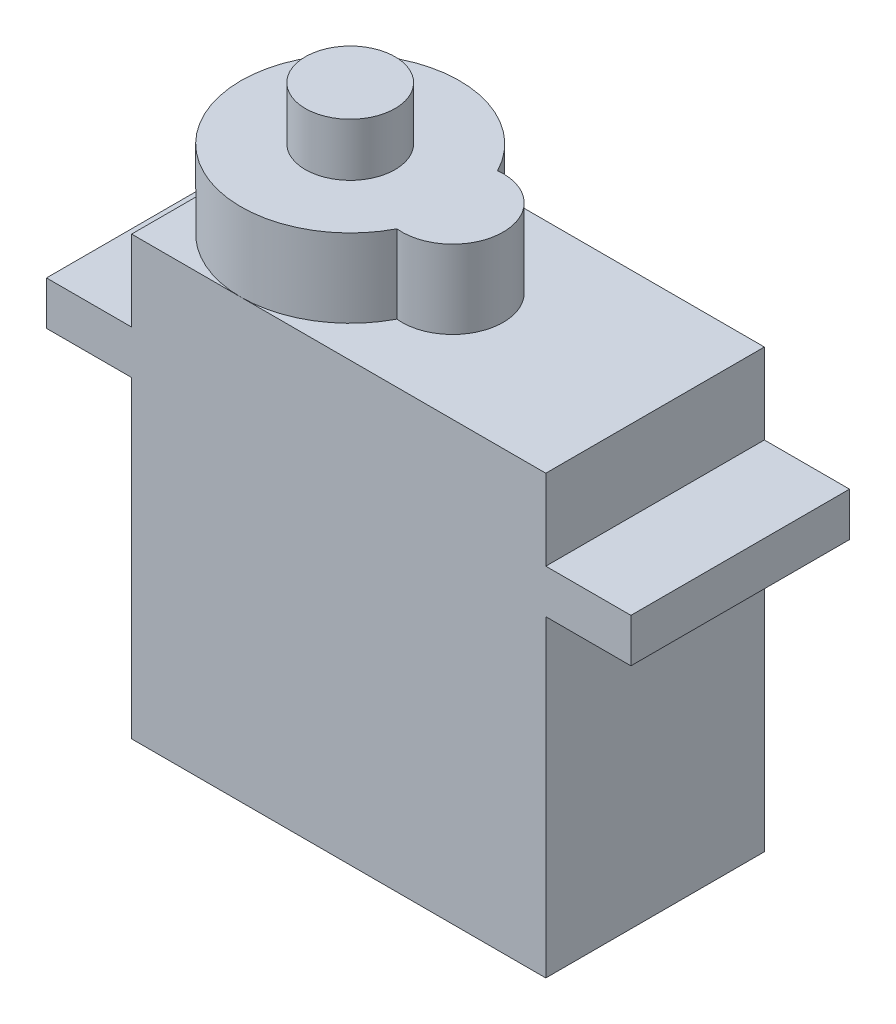
ISO-10303-21;
HEADER;
FILE_DESCRIPTION(('STEP AP214'),'2;1');
FILE_NAME('part.step','',(''),(''),'','','');
FILE_SCHEMA(('AUTOMOTIVE_DESIGN { 1 0 10303 214 1 1 1 1 }'));
ENDSEC;
DATA;
#1=APPLICATION_CONTEXT('core data for automotive mechanical design processes');
#2=APPLICATION_PROTOCOL_DEFINITION('international standard','automotive_design',2000,#1);
#3=PRODUCT_CONTEXT('',#1,'mechanical');
#4=PRODUCT('Part','Part','',(#3));
#5=PRODUCT_RELATED_PRODUCT_CATEGORY('part','',(#4));
#6=PRODUCT_DEFINITION_FORMATION('','',#4);
#7=PRODUCT_DEFINITION_CONTEXT('part definition',#1,'design');
#8=PRODUCT_DEFINITION('design','',#6,#7);
#9=PRODUCT_DEFINITION_SHAPE('','',#8);
#10=(LENGTH_UNIT() NAMED_UNIT(*) SI_UNIT(.MILLI.,.METRE.));
#11=(NAMED_UNIT(*) PLANE_ANGLE_UNIT() SI_UNIT($,.RADIAN.));
#12=(NAMED_UNIT(*) SI_UNIT($,.STERADIAN.) SOLID_ANGLE_UNIT());
#13=UNCERTAINTY_MEASURE_WITH_UNIT(LENGTH_MEASURE(1.E-05),#10,'distance_accuracy_value','');
#14=(GEOMETRIC_REPRESENTATION_CONTEXT(3) GLOBAL_UNCERTAINTY_ASSIGNED_CONTEXT((#13)) GLOBAL_UNIT_ASSIGNED_CONTEXT((#10,
#11,#12)) REPRESENTATION_CONTEXT('',''));
#15=CARTESIAN_POINT('',(0.,0.,0.));
#16=DIRECTION('',(0.,0.,1.));
#17=DIRECTION('',(1.,0.,0.));
#18=AXIS2_PLACEMENT_3D('',#15,#16,#17);
#19=CARTESIAN_POINT('',(0.,24.13,12.065));
#20=DIRECTION('',(0.,-1.,0.));
#21=DIRECTION('',(1.,0.,0.));
#22=AXIS2_PLACEMENT_3D('',#19,#20,#21);
#23=PLANE('',#22);
#24=CARTESIAN_POINT('',(11.684,24.13,6.0325));
#25=DIRECTION('',(0.,1.,0.));
#26=DIRECTION('',(0.,0.,1.));
#27=AXIS2_PLACEMENT_3D('',#24,#25,#26);
#28=CIRCLE('',#27,2.794);
#29=CARTESIAN_POINT('',(11.387191011236,24.13,8.81069013463601));
#30=VERTEX_POINT('',#29);
#31=CARTESIAN_POINT('',(11.387191011236,24.13,3.25430986536399));
#32=VERTEX_POINT('',#31);
#33=EDGE_CURVE('E176',#30,#32,#28,.T.);
#34=ORIENTED_EDGE('',*,*,#33,.F.);
#35=CARTESIAN_POINT('',(6.0325,24.13,6.0325));
#36=DIRECTION('',(0.,1.,0.));
#37=DIRECTION('',(0.,0.,1.));
#38=AXIS2_PLACEMENT_3D('',#35,#36,#37);
#39=CIRCLE('',#38,6.0325);
#40=CARTESIAN_POINT('',(6.0325,24.13,12.065));
#41=VERTEX_POINT('',#40);
#42=EDGE_CURVE('E69',#41,#30,#39,.T.);
#43=ORIENTED_EDGE('',*,*,#42,.F.);
#44=DIRECTION('',(-1.,0.,0.));
#45=VECTOR('',#44,1.);
#46=CARTESIAN_POINT('',(0.,24.13,12.065));
#47=LINE('',#46,#45);
#48=CARTESIAN_POINT('',(22.86,24.13,12.065));
#49=VERTEX_POINT('',#48);
#50=EDGE_CURVE('E211',#49,#41,#47,.T.);
#51=ORIENTED_EDGE('',*,*,#50,.F.);
#52=DIRECTION('',(0.,0.,-1.));
#53=VECTOR('',#52,1.);
#54=CARTESIAN_POINT('',(22.86,24.13,12.065));
#55=LINE('',#54,#53);
#56=CARTESIAN_POINT('',(22.86,24.13,0.));
#57=VERTEX_POINT('',#56);
#58=EDGE_CURVE('E280',#49,#57,#55,.T.);
#59=ORIENTED_EDGE('',*,*,#58,.T.);
#60=DIRECTION('',(-1.,0.,0.));
#61=VECTOR('',#60,1.);
#62=CARTESIAN_POINT('',(0.,24.13,0.));
#63=LINE('',#62,#61);
#64=CARTESIAN_POINT('',(6.0325,24.13,0.));
#65=VERTEX_POINT('',#64);
#66=EDGE_CURVE('E246',#57,#65,#63,.T.);
#67=ORIENTED_EDGE('',*,*,#66,.T.);
#68=EDGE_CURVE('E57',#32,#65,#39,.T.);
#69=ORIENTED_EDGE('',*,*,#68,.F.);
#70=EDGE_LOOP('',(#34,#43,#51,#59,#67,#69));
#71=FACE_BOUND('',#70,.T.);
#72=ADVANCED_FACE('F45',(#71),#23,.F.);
#73=CARTESIAN_POINT('',(0.,24.13,6.0325));
#74=VERTEX_POINT('',#73);
#75=EDGE_CURVE('E11',#65,#74,#39,.T.);
#76=ORIENTED_EDGE('',*,*,#75,.F.);
#77=CARTESIAN_POINT('',(0.,24.13,0.));
#78=VERTEX_POINT('',#77);
#79=EDGE_CURVE('E245',#65,#78,#63,.T.);
#80=ORIENTED_EDGE('',*,*,#79,.T.);
#81=DIRECTION('',(0.,0.,-1.));
#82=VECTOR('',#81,1.);
#83=CARTESIAN_POINT('',(0.,24.13,12.065));
#84=LINE('',#83,#82);
#85=EDGE_CURVE('E275',#74,#78,#84,.T.);
#86=ORIENTED_EDGE('',*,*,#85,.F.);
#87=EDGE_LOOP('',(#76,#80,#86));
#88=FACE_BOUND('',#87,.T.);
#89=ADVANCED_FACE('F339',(#88),#23,.F.);
#90=CARTESIAN_POINT('',(0.,0.,12.065));
#91=DIRECTION('',(1.,0.,0.));
#92=DIRECTION('',(0.,1.,0.));
#93=AXIS2_PLACEMENT_3D('',#90,#91,#92);
#94=PLANE('',#93);
#95=DIRECTION('',(0.,-1.,0.));
#96=VECTOR('',#95,1.);
#97=CARTESIAN_POINT('',(0.,0.,0.));
#98=LINE('',#97,#96);
#99=CARTESIAN_POINT('',(0.,17.272,0.));
#100=VERTEX_POINT('',#99);
#101=CARTESIAN_POINT('',(0.,0.,0.));
#102=VERTEX_POINT('',#101);
#103=EDGE_CURVE('E178',#100,#102,#98,.T.);
#104=ORIENTED_EDGE('',*,*,#103,.T.);
#105=DIRECTION('',(0.,0.,-1.));
#106=VECTOR('',#105,1.);
#107=CARTESIAN_POINT('',(0.,0.,12.065));
#108=LINE('',#107,#106);
#109=CARTESIAN_POINT('',(0.,0.,12.065));
#110=VERTEX_POINT('',#109);
#111=EDGE_CURVE('E49',#110,#102,#108,.T.);
#112=ORIENTED_EDGE('',*,*,#111,.F.);
#113=DIRECTION('',(0.,-1.,0.));
#114=VECTOR('',#113,1.);
#115=CARTESIAN_POINT('',(0.,0.,12.065));
#116=LINE('',#115,#114);
#117=CARTESIAN_POINT('',(0.,17.272,12.065));
#118=VERTEX_POINT('',#117);
#119=EDGE_CURVE('E187',#118,#110,#116,.T.);
#120=ORIENTED_EDGE('',*,*,#119,.F.);
#121=DIRECTION('',(0.,0.,-1.));
#122=VECTOR('',#121,1.);
#123=CARTESIAN_POINT('',(0.,17.272,12.065));
#124=LINE('',#123,#122);
#125=EDGE_CURVE('E226',#118,#100,#124,.T.);
#126=ORIENTED_EDGE('',*,*,#125,.T.);
#127=EDGE_LOOP('',(#104,#112,#120,#126));
#128=FACE_BOUND('',#127,.T.);
#129=ADVANCED_FACE('F47',(#128),#94,.F.);
#130=CARTESIAN_POINT('',(0.,0.,12.065));
#131=DIRECTION('',(0.,1.,0.));
#132=DIRECTION('',(-1.,0.,0.));
#133=AXIS2_PLACEMENT_3D('',#130,#131,#132);
#134=PLANE('',#133);
#135=DIRECTION('',(1.,0.,0.));
#136=VECTOR('',#135,1.);
#137=CARTESIAN_POINT('',(0.,0.,0.));
#138=LINE('',#137,#136);
#139=CARTESIAN_POINT('',(22.86,0.,0.));
#140=VERTEX_POINT('',#139);
#141=EDGE_CURVE('E183',#102,#140,#138,.T.);
#142=ORIENTED_EDGE('',*,*,#141,.T.);
#143=DIRECTION('',(0.,0.,-1.));
#144=VECTOR('',#143,1.);
#145=CARTESIAN_POINT('',(22.86,0.,12.065));
#146=LINE('',#145,#144);
#147=CARTESIAN_POINT('',(22.86,0.,12.065));
#148=VERTEX_POINT('',#147);
#149=EDGE_CURVE('E299',#148,#140,#146,.T.);
#150=ORIENTED_EDGE('',*,*,#149,.F.);
#151=DIRECTION('',(1.,0.,0.));
#152=VECTOR('',#151,1.);
#153=CARTESIAN_POINT('',(0.,0.,12.065));
#154=LINE('',#153,#152);
#155=EDGE_CURVE('E191',#110,#148,#154,.T.);
#156=ORIENTED_EDGE('',*,*,#155,.F.);
#157=ORIENTED_EDGE('',*,*,#111,.T.);
#158=EDGE_LOOP('',(#142,#150,#156,#157));
#159=FACE_BOUND('',#158,.T.);
#160=ADVANCED_FACE('F397',(#159),#134,.F.);
#161=CARTESIAN_POINT('',(22.86,0.,12.065));
#162=DIRECTION('',(-1.,0.,0.));
#163=DIRECTION('',(0.,-1.,0.));
#164=AXIS2_PLACEMENT_3D('',#161,#162,#163);
#165=PLANE('',#164);
#166=DIRECTION('',(0.,1.,0.));
#167=VECTOR('',#166,1.);
#168=CARTESIAN_POINT('',(22.86,0.,0.));
#169=LINE('',#168,#167);
#170=CARTESIAN_POINT('',(22.86,17.272,0.));
#171=VERTEX_POINT('',#170);
#172=EDGE_CURVE('E230',#140,#171,#169,.T.);
#173=ORIENTED_EDGE('',*,*,#172,.T.);
#174=DIRECTION('',(0.,0.,-1.));
#175=VECTOR('',#174,1.);
#176=CARTESIAN_POINT('',(22.86,17.272,12.065));
#177=LINE('',#176,#175);
#178=CARTESIAN_POINT('',(22.86,17.272,12.065));
#179=VERTEX_POINT('',#178);
#180=EDGE_CURVE('E296',#179,#171,#177,.T.);
#181=ORIENTED_EDGE('',*,*,#180,.F.);
#182=DIRECTION('',(0.,1.,0.));
#183=VECTOR('',#182,1.);
#184=CARTESIAN_POINT('',(22.86,0.,12.065));
#185=LINE('',#184,#183);
#186=EDGE_CURVE('E195',#148,#179,#185,.T.);
#187=ORIENTED_EDGE('',*,*,#186,.F.);
#188=ORIENTED_EDGE('',*,*,#149,.T.);
#189=EDGE_LOOP('',(#173,#181,#187,#188));
#190=FACE_BOUND('',#189,.T.);
#191=ADVANCED_FACE('F399',(#190),#165,.F.);
#192=CARTESIAN_POINT('',(22.86,17.272,12.065));
#193=DIRECTION('',(0.,1.,0.));
#194=DIRECTION('',(0.,0.,1.));
#195=AXIS2_PLACEMENT_3D('',#192,#193,#194);
#196=PLANE('',#195);
#197=DIRECTION('',(1.,0.,0.));
#198=VECTOR('',#197,1.);
#199=CARTESIAN_POINT('',(22.86,17.272,0.));
#200=LINE('',#199,#198);
#201=CARTESIAN_POINT('',(27.559,17.272,0.));
#202=VERTEX_POINT('',#201);
#203=EDGE_CURVE('E233',#171,#202,#200,.T.);
#204=ORIENTED_EDGE('',*,*,#203,.T.);
#205=DIRECTION('',(0.,0.,-1.));
#206=VECTOR('',#205,1.);
#207=CARTESIAN_POINT('',(27.559,17.272,12.065));
#208=LINE('',#207,#206);
#209=CARTESIAN_POINT('',(27.559,17.272,12.065));
#210=VERTEX_POINT('',#209);
#211=EDGE_CURVE('E292',#210,#202,#208,.T.);
#212=ORIENTED_EDGE('',*,*,#211,.F.);
#213=DIRECTION('',(1.,0.,0.));
#214=VECTOR('',#213,1.);
#215=CARTESIAN_POINT('',(22.86,17.272,12.065));
#216=LINE('',#215,#214);
#217=EDGE_CURVE('E198',#179,#210,#216,.T.);
#218=ORIENTED_EDGE('',*,*,#217,.F.);
#219=ORIENTED_EDGE('',*,*,#180,.T.);
#220=EDGE_LOOP('',(#204,#212,#218,#219));
#221=FACE_BOUND('',#220,.T.);
#222=ADVANCED_FACE('F405',(#221),#196,.F.);
#223=CARTESIAN_POINT('',(27.559,19.685,12.065));
#224=DIRECTION('',(-1.,0.,0.));
#225=DIRECTION('',(0.,0.,1.));
#226=AXIS2_PLACEMENT_3D('',#223,#224,#225);
#227=PLANE('',#226);
#228=DIRECTION('',(0.,1.,0.));
#229=VECTOR('',#228,1.);
#230=CARTESIAN_POINT('',(27.559,19.685,0.));
#231=LINE('',#230,#229);
#232=CARTESIAN_POINT('',(27.559,19.685,0.));
#233=VERTEX_POINT('',#232);
#234=EDGE_CURVE('E236',#202,#233,#231,.T.);
#235=ORIENTED_EDGE('',*,*,#234,.T.);
#236=DIRECTION('',(0.,0.,-1.));
#237=VECTOR('',#236,1.);
#238=CARTESIAN_POINT('',(27.559,19.685,12.065));
#239=LINE('',#238,#237);
#240=CARTESIAN_POINT('',(27.559,19.685,12.065));
#241=VERTEX_POINT('',#240);
#242=EDGE_CURVE('E288',#241,#233,#239,.T.);
#243=ORIENTED_EDGE('',*,*,#242,.F.);
#244=DIRECTION('',(0.,1.,0.));
#245=VECTOR('',#244,1.);
#246=CARTESIAN_POINT('',(27.559,19.685,12.065));
#247=LINE('',#246,#245);
#248=EDGE_CURVE('E201',#210,#241,#247,.T.);
#249=ORIENTED_EDGE('',*,*,#248,.F.);
#250=ORIENTED_EDGE('',*,*,#211,.T.);
#251=EDGE_LOOP('',(#235,#243,#249,#250));
#252=FACE_BOUND('',#251,.T.);
#253=ADVANCED_FACE('F408',(#252),#227,.F.);
#254=CARTESIAN_POINT('',(22.86,19.685,12.065));
#255=DIRECTION('',(0.,-1.,0.));
#256=DIRECTION('',(0.,0.,-1.));
#257=AXIS2_PLACEMENT_3D('',#254,#255,#256);
#258=PLANE('',#257);
#259=DIRECTION('',(-1.,0.,0.));
#260=VECTOR('',#259,1.);
#261=CARTESIAN_POINT('',(22.86,19.685,0.));
#262=LINE('',#261,#260);
#263=CARTESIAN_POINT('',(22.86,19.685,0.));
#264=VERTEX_POINT('',#263);
#265=EDGE_CURVE('E239',#233,#264,#262,.T.);
#266=ORIENTED_EDGE('',*,*,#265,.T.);
#267=DIRECTION('',(0.,0.,-1.));
#268=VECTOR('',#267,1.);
#269=CARTESIAN_POINT('',(22.86,19.685,12.065));
#270=LINE('',#269,#268);
#271=CARTESIAN_POINT('',(22.86,19.685,12.065));
#272=VERTEX_POINT('',#271);
#273=EDGE_CURVE('E284',#272,#264,#270,.T.);
#274=ORIENTED_EDGE('',*,*,#273,.F.);
#275=DIRECTION('',(-1.,0.,0.));
#276=VECTOR('',#275,1.);
#277=CARTESIAN_POINT('',(22.86,19.685,12.065));
#278=LINE('',#277,#276);
#279=EDGE_CURVE('E204',#241,#272,#278,.T.);
#280=ORIENTED_EDGE('',*,*,#279,.F.);
#281=ORIENTED_EDGE('',*,*,#242,.T.);
#282=EDGE_LOOP('',(#266,#274,#280,#281));
#283=FACE_BOUND('',#282,.T.);
#284=ADVANCED_FACE('F358',(#283),#258,.F.);
#285=CARTESIAN_POINT('',(22.86,19.685,12.065));
#286=DIRECTION('',(-1.,0.,0.));
#287=DIRECTION('',(0.,-1.,0.));
#288=AXIS2_PLACEMENT_3D('',#285,#286,#287);
#289=PLANE('',#288);
#290=DIRECTION('',(0.,1.,0.));
#291=VECTOR('',#290,1.);
#292=CARTESIAN_POINT('',(22.86,19.685,0.));
#293=LINE('',#292,#291);
#294=EDGE_CURVE('E242',#264,#57,#293,.T.);
#295=ORIENTED_EDGE('',*,*,#294,.T.);
#296=ORIENTED_EDGE('',*,*,#58,.F.);
#297=DIRECTION('',(0.,1.,0.));
#298=VECTOR('',#297,1.);
#299=CARTESIAN_POINT('',(22.86,19.685,12.065));
#300=LINE('',#299,#298);
#301=EDGE_CURVE('E207',#272,#49,#300,.T.);
#302=ORIENTED_EDGE('',*,*,#301,.F.);
#303=ORIENTED_EDGE('',*,*,#273,.T.);
#304=EDGE_LOOP('',(#295,#296,#302,#303));
#305=FACE_BOUND('',#304,.T.);
#306=ADVANCED_FACE('F350',(#305),#289,.F.);
#307=EDGE_CURVE('E55',#74,#41,#39,.T.);
#308=ORIENTED_EDGE('',*,*,#307,.F.);
#309=CARTESIAN_POINT('',(0.,24.13,12.065));
#310=VERTEX_POINT('',#309);
#311=EDGE_CURVE('E276',#310,#74,#84,.T.);
#312=ORIENTED_EDGE('',*,*,#311,.F.);
#313=EDGE_CURVE('E210',#41,#310,#47,.T.);
#314=ORIENTED_EDGE('',*,*,#313,.F.);
#315=EDGE_LOOP('',(#308,#312,#314));
#316=FACE_BOUND('',#315,.T.);
#317=ADVANCED_FACE('F341',(#316),#23,.F.);
#318=CARTESIAN_POINT('',(0.,19.685,12.065));
#319=DIRECTION('',(1.,0.,0.));
#320=DIRECTION('',(0.,1.,0.));
#321=AXIS2_PLACEMENT_3D('',#318,#319,#320);
#322=PLANE('',#321);
#323=DIRECTION('',(0.,-1.,0.));
#324=VECTOR('',#323,1.);
#325=CARTESIAN_POINT('',(0.,19.685,0.));
#326=LINE('',#325,#324);
#327=CARTESIAN_POINT('',(0.,19.685,0.));
#328=VERTEX_POINT('',#327);
#329=EDGE_CURVE('E249',#78,#328,#326,.T.);
#330=ORIENTED_EDGE('',*,*,#329,.T.);
#331=DIRECTION('',(0.,0.,-1.));
#332=VECTOR('',#331,1.);
#333=CARTESIAN_POINT('',(0.,19.685,12.065));
#334=LINE('',#333,#332);
#335=CARTESIAN_POINT('',(0.,19.685,12.065));
#336=VERTEX_POINT('',#335);
#337=EDGE_CURVE('E271',#336,#328,#334,.T.);
#338=ORIENTED_EDGE('',*,*,#337,.F.);
#339=DIRECTION('',(0.,-1.,0.));
#340=VECTOR('',#339,1.);
#341=CARTESIAN_POINT('',(0.,19.685,12.065));
#342=LINE('',#341,#340);
#343=EDGE_CURVE('E215',#310,#336,#342,.T.);
#344=ORIENTED_EDGE('',*,*,#343,.F.);
#345=ORIENTED_EDGE('',*,*,#311,.T.);
#346=ORIENTED_EDGE('',*,*,#85,.T.);
#347=EDGE_LOOP('',(#330,#338,#344,#345,#346));
#348=FACE_BOUND('',#347,.T.);
#349=ADVANCED_FACE('F349',(#348),#322,.F.);
#350=CARTESIAN_POINT('',(0.,19.685,12.065));
#351=DIRECTION('',(0.,-1.,0.));
#352=DIRECTION('',(0.,0.,-1.));
#353=AXIS2_PLACEMENT_3D('',#350,#351,#352);
#354=PLANE('',#353);
#355=DIRECTION('',(-1.,0.,0.));
#356=VECTOR('',#355,1.);
#357=CARTESIAN_POINT('',(0.,19.685,0.));
#358=LINE('',#357,#356);
#359=CARTESIAN_POINT('',(-4.69900000000001,19.685,0.));
#360=VERTEX_POINT('',#359);
#361=EDGE_CURVE('E252',#328,#360,#358,.T.);
#362=ORIENTED_EDGE('',*,*,#361,.T.);
#363=DIRECTION('',(0.,0.,-1.));
#364=VECTOR('',#363,1.);
#365=CARTESIAN_POINT('',(-4.69900000000001,19.685,12.065));
#366=LINE('',#365,#364);
#367=CARTESIAN_POINT('',(-4.69900000000001,19.685,12.065));
#368=VERTEX_POINT('',#367);
#369=EDGE_CURVE('E267',#368,#360,#366,.T.);
#370=ORIENTED_EDGE('',*,*,#369,.F.);
#371=DIRECTION('',(-1.,0.,0.));
#372=VECTOR('',#371,1.);
#373=CARTESIAN_POINT('',(0.,19.685,12.065));
#374=LINE('',#373,#372);
#375=EDGE_CURVE('E218',#336,#368,#374,.T.);
#376=ORIENTED_EDGE('',*,*,#375,.F.);
#377=ORIENTED_EDGE('',*,*,#337,.T.);
#378=EDGE_LOOP('',(#362,#370,#376,#377));
#379=FACE_BOUND('',#378,.T.);
#380=ADVANCED_FACE('F356',(#379),#354,.F.);
#381=CARTESIAN_POINT('',(-4.69900000000001,19.685,12.065));
#382=DIRECTION('',(1.,0.,0.));
#383=DIRECTION('',(0.,1.,0.));
#384=AXIS2_PLACEMENT_3D('',#381,#382,#383);
#385=PLANE('',#384);
#386=DIRECTION('',(0.,-1.,0.));
#387=VECTOR('',#386,1.);
#388=CARTESIAN_POINT('',(-4.69900000000001,19.685,0.));
#389=LINE('',#388,#387);
#390=CARTESIAN_POINT('',(-4.699,17.272,0.));
#391=VERTEX_POINT('',#390);
#392=EDGE_CURVE('E255',#360,#391,#389,.T.);
#393=ORIENTED_EDGE('',*,*,#392,.T.);
#394=DIRECTION('',(0.,0.,-1.));
#395=VECTOR('',#394,1.);
#396=CARTESIAN_POINT('',(-4.699,17.272,12.065));
#397=LINE('',#396,#395);
#398=CARTESIAN_POINT('',(-4.699,17.272,12.065));
#399=VERTEX_POINT('',#398);
#400=EDGE_CURVE('E263',#399,#391,#397,.T.);
#401=ORIENTED_EDGE('',*,*,#400,.F.);
#402=DIRECTION('',(0.,-1.,0.));
#403=VECTOR('',#402,1.);
#404=CARTESIAN_POINT('',(-4.69900000000001,19.685,12.065));
#405=LINE('',#404,#403);
#406=EDGE_CURVE('E221',#368,#399,#405,.T.);
#407=ORIENTED_EDGE('',*,*,#406,.F.);
#408=ORIENTED_EDGE('',*,*,#369,.T.);
#409=EDGE_LOOP('',(#393,#401,#407,#408));
#410=FACE_BOUND('',#409,.T.);
#411=ADVANCED_FACE('F388',(#410),#385,.F.);
#412=CARTESIAN_POINT('',(0.,17.272,12.065));
#413=DIRECTION('',(0.,1.,0.));
#414=DIRECTION('',(0.,0.,1.));
#415=AXIS2_PLACEMENT_3D('',#412,#413,#414);
#416=PLANE('',#415);
#417=DIRECTION('',(1.,0.,0.));
#418=VECTOR('',#417,1.);
#419=CARTESIAN_POINT('',(0.,17.272,0.));
#420=LINE('',#419,#418);
#421=EDGE_CURVE('E192',#391,#100,#420,.T.);
#422=ORIENTED_EDGE('',*,*,#421,.T.);
#423=ORIENTED_EDGE('',*,*,#125,.F.);
#424=DIRECTION('',(1.,0.,0.));
#425=VECTOR('',#424,1.);
#426=CARTESIAN_POINT('',(0.,17.272,12.065));
#427=LINE('',#426,#425);
#428=EDGE_CURVE('E224',#399,#118,#427,.T.);
#429=ORIENTED_EDGE('',*,*,#428,.F.);
#430=ORIENTED_EDGE('',*,*,#400,.T.);
#431=EDGE_LOOP('',(#422,#423,#429,#430));
#432=FACE_BOUND('',#431,.T.);
#433=ADVANCED_FACE('F393',(#432),#416,.F.);
#434=CARTESIAN_POINT('',(0.,0.,12.065));
#435=DIRECTION('',(0.,0.,1.));
#436=DIRECTION('',(1.,0.,0.));
#437=AXIS2_PLACEMENT_3D('',#434,#435,#436);
#438=PLANE('',#437);
#439=ORIENTED_EDGE('',*,*,#119,.T.);
#440=ORIENTED_EDGE('',*,*,#155,.T.);
#441=ORIENTED_EDGE('',*,*,#186,.T.);
#442=ORIENTED_EDGE('',*,*,#217,.T.);
#443=ORIENTED_EDGE('',*,*,#248,.T.);
#444=ORIENTED_EDGE('',*,*,#279,.T.);
#445=ORIENTED_EDGE('',*,*,#301,.T.);
#446=ORIENTED_EDGE('',*,*,#50,.T.);
#447=ORIENTED_EDGE('',*,*,#313,.T.);
#448=ORIENTED_EDGE('',*,*,#343,.T.);
#449=ORIENTED_EDGE('',*,*,#375,.T.);
#450=ORIENTED_EDGE('',*,*,#406,.T.);
#451=ORIENTED_EDGE('',*,*,#428,.T.);
#452=EDGE_LOOP('',(#439,#440,#441,#442,#443,#444,#445,#446,#447,#448,#449,#450,#451));
#453=FACE_BOUND('',#452,.T.);
#454=ADVANCED_FACE('F370',(#453),#438,.T.);
#455=CARTESIAN_POINT('',(0.,0.,0.));
#456=DIRECTION('',(0.,0.,1.));
#457=DIRECTION('',(1.,0.,0.));
#458=AXIS2_PLACEMENT_3D('',#455,#456,#457);
#459=PLANE('',#458);
#460=ORIENTED_EDGE('',*,*,#103,.F.);
#461=ORIENTED_EDGE('',*,*,#421,.F.);
#462=ORIENTED_EDGE('',*,*,#392,.F.);
#463=ORIENTED_EDGE('',*,*,#361,.F.);
#464=ORIENTED_EDGE('',*,*,#329,.F.);
#465=ORIENTED_EDGE('',*,*,#79,.F.);
#466=ORIENTED_EDGE('',*,*,#66,.F.);
#467=ORIENTED_EDGE('',*,*,#294,.F.);
#468=ORIENTED_EDGE('',*,*,#265,.F.);
#469=ORIENTED_EDGE('',*,*,#234,.F.);
#470=ORIENTED_EDGE('',*,*,#203,.F.);
#471=ORIENTED_EDGE('',*,*,#172,.F.);
#472=ORIENTED_EDGE('',*,*,#141,.F.);
#473=EDGE_LOOP('',(#460,#461,#462,#463,#464,#465,#466,#467,#468,#469,#470,#471,#472));
#474=FACE_BOUND('',#473,.T.);
#475=ADVANCED_FACE('F380',(#474),#459,.F.);
#476=CARTESIAN_POINT('',(11.684,28.448,6.0325));
#477=DIRECTION('',(0.,-1.,0.));
#478=DIRECTION('',(0.,0.,-1.));
#479=AXIS2_PLACEMENT_3D('',#476,#477,#478);
#480=CYLINDRICAL_SURFACE('',#479,2.794);
#481=ORIENTED_EDGE('',*,*,#33,.T.);
#482=DIRECTION('',(0.,-1.,0.));
#483=VECTOR('',#482,1.);
#484=CARTESIAN_POINT('',(11.387191011236,28.448,3.25430986536399));
#485=LINE('',#484,#483);
#486=CARTESIAN_POINT('',(11.387191011236,28.448,3.25430986536399));
#487=VERTEX_POINT('',#486);
#488=EDGE_CURVE('E162',#487,#32,#485,.T.);
#489=ORIENTED_EDGE('',*,*,#488,.F.);
#490=CARTESIAN_POINT('',(11.684,28.448,6.0325));
#491=DIRECTION('',(0.,1.,0.));
#492=DIRECTION('',(0.,0.,1.));
#493=AXIS2_PLACEMENT_3D('',#490,#491,#492);
#494=CIRCLE('',#493,2.794);
#495=CARTESIAN_POINT('',(11.387191011236,28.448,8.81069013463601));
#496=VERTEX_POINT('',#495);
#497=EDGE_CURVE('E169',#496,#487,#494,.T.);
#498=ORIENTED_EDGE('',*,*,#497,.F.);
#499=DIRECTION('',(0.,-1.,0.));
#500=VECTOR('',#499,1.);
#501=CARTESIAN_POINT('',(11.387191011236,28.448,8.81069013463601));
#502=LINE('',#501,#500);
#503=EDGE_CURVE('E165',#496,#30,#502,.T.);
#504=ORIENTED_EDGE('',*,*,#503,.T.);
#505=EDGE_LOOP('',(#481,#489,#498,#504));
#506=FACE_BOUND('',#505,.T.);
#507=ADVANCED_FACE('F175',(#506),#480,.T.);
#508=CARTESIAN_POINT('',(6.0325,28.448,6.0325));
#509=DIRECTION('',(0.,-1.,0.));
#510=DIRECTION('',(0.,0.,-1.));
#511=AXIS2_PLACEMENT_3D('',#508,#509,#510);
#512=CYLINDRICAL_SURFACE('',#511,6.0325);
#513=ORIENTED_EDGE('',*,*,#68,.T.);
#514=ORIENTED_EDGE('',*,*,#75,.T.);
#515=ORIENTED_EDGE('',*,*,#307,.T.);
#516=ORIENTED_EDGE('',*,*,#42,.T.);
#517=ORIENTED_EDGE('',*,*,#503,.F.);
#518=CARTESIAN_POINT('',(6.0325,28.448,6.0325));
#519=DIRECTION('',(0.,1.,0.));
#520=DIRECTION('',(0.,0.,1.));
#521=AXIS2_PLACEMENT_3D('',#518,#519,#520);
#522=CIRCLE('',#521,6.0325);
#523=EDGE_CURVE('E158',#487,#496,#522,.T.);
#524=ORIENTED_EDGE('',*,*,#523,.F.);
#525=ORIENTED_EDGE('',*,*,#488,.T.);
#526=EDGE_LOOP('',(#513,#514,#515,#516,#517,#524,#525));
#527=FACE_BOUND('',#526,.T.);
#528=ADVANCED_FACE('F160',(#527),#512,.T.);
#529=CARTESIAN_POINT('',(0.,28.448,0.));
#530=DIRECTION('',(0.,1.,0.));
#531=DIRECTION('',(0.,0.,1.));
#532=AXIS2_PLACEMENT_3D('',#529,#530,#531);
#533=PLANE('',#532);
#534=CARTESIAN_POINT('',(6.0325,28.448,6.0325));
#535=DIRECTION('',(0.,1.,0.));
#536=DIRECTION('',(0.,0.,1.));
#537=AXIS2_PLACEMENT_3D('',#534,#535,#536);
#538=CIRCLE('',#537,2.4765);
#539=CARTESIAN_POINT('',(6.0325,28.448,8.509));
#540=VERTEX_POINT('',#539);
#541=EDGE_CURVE('E319',#540,#540,#538,.T.);
#542=ORIENTED_EDGE('',*,*,#541,.F.);
#543=EDGE_LOOP('',(#542));
#544=FACE_BOUND('',#543,.T.);
#545=ORIENTED_EDGE('',*,*,#497,.T.);
#546=ORIENTED_EDGE('',*,*,#523,.T.);
#547=EDGE_LOOP('',(#545,#546));
#548=FACE_BOUND('',#547,.T.);
#549=ADVANCED_FACE('F171',(#544,#548),#533,.T.);
#550=CARTESIAN_POINT('',(6.0325,31.369,6.0325));
#551=DIRECTION('',(0.,-1.,0.));
#552=DIRECTION('',(0.,0.,-1.));
#553=AXIS2_PLACEMENT_3D('',#550,#551,#552);
#554=CYLINDRICAL_SURFACE('',#553,2.4765);
#555=CARTESIAN_POINT('',(6.0325,31.369,6.0325));
#556=DIRECTION('',(0.,1.,0.));
#557=DIRECTION('',(0.,0.,1.));
#558=AXIS2_PLACEMENT_3D('',#555,#556,#557);
#559=CIRCLE('',#558,2.4765);
#560=CARTESIAN_POINT('',(6.0325,31.369,8.509));
#561=VERTEX_POINT('',#560);
#562=EDGE_CURVE('E316',#561,#561,#559,.T.);
#563=ORIENTED_EDGE('',*,*,#562,.F.);
#564=EDGE_LOOP('',(#563));
#565=FACE_BOUND('',#564,.T.);
#566=ORIENTED_EDGE('',*,*,#541,.T.);
#567=EDGE_LOOP('',(#566));
#568=FACE_BOUND('',#567,.T.);
#569=ADVANCED_FACE('F326',(#565,#568),#554,.T.);
#570=CARTESIAN_POINT('',(6.0325,31.369,6.0325));
#571=DIRECTION('',(0.,1.,0.));
#572=DIRECTION('',(0.,0.,1.));
#573=AXIS2_PLACEMENT_3D('',#570,#571,#572);
#574=PLANE('',#573);
#575=ORIENTED_EDGE('',*,*,#562,.T.);
#576=EDGE_LOOP('',(#575));
#577=FACE_BOUND('',#576,.T.);
#578=ADVANCED_FACE('F334',(#577),#574,.T.);
#579=CLOSED_SHELL('',(#72,#89,#129,#160,#191,#222,#253,#284,#306,#317,#349,#380,#411,#433,#454,
#475,#507,#528,#549,#569,#578));
#580=MANIFOLD_SOLID_BREP('B2',#579);
#581=ADVANCED_BREP_SHAPE_REPRESENTATION('',(#18,#580),#14);
#582=SHAPE_DEFINITION_REPRESENTATION(#9,#581);
ENDSEC;
END-ISO-10303-21;
